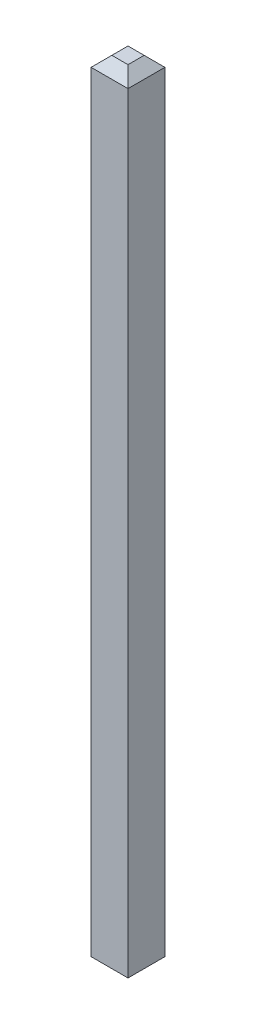
ISO-10303-21;
HEADER;
FILE_DESCRIPTION(('STEP AP214'),'2;1');
FILE_NAME('part.step','',(''),(''),'','','');
FILE_SCHEMA(('AUTOMOTIVE_DESIGN { 1 0 10303 214 1 1 1 1 }'));
ENDSEC;
DATA;
#1=APPLICATION_CONTEXT('core data for automotive mechanical design processes');
#2=APPLICATION_PROTOCOL_DEFINITION('international standard','automotive_design',2000,#1);
#3=PRODUCT_CONTEXT('',#1,'mechanical');
#4=PRODUCT('Part','Part','',(#3));
#5=PRODUCT_RELATED_PRODUCT_CATEGORY('part','',(#4));
#6=PRODUCT_DEFINITION_FORMATION('','',#4);
#7=PRODUCT_DEFINITION_CONTEXT('part definition',#1,'design');
#8=PRODUCT_DEFINITION('design','',#6,#7);
#9=PRODUCT_DEFINITION_SHAPE('','',#8);
#10=(LENGTH_UNIT() NAMED_UNIT(*) SI_UNIT(.MILLI.,.METRE.));
#11=(NAMED_UNIT(*) PLANE_ANGLE_UNIT() SI_UNIT($,.RADIAN.));
#12=(NAMED_UNIT(*) SI_UNIT($,.STERADIAN.) SOLID_ANGLE_UNIT());
#13=UNCERTAINTY_MEASURE_WITH_UNIT(LENGTH_MEASURE(1.E-05),#10,'distance_accuracy_value','');
#14=(GEOMETRIC_REPRESENTATION_CONTEXT(3) GLOBAL_UNCERTAINTY_ASSIGNED_CONTEXT((#13)) GLOBAL_UNIT_ASSIGNED_CONTEXT((#10,
#11,#12)) REPRESENTATION_CONTEXT('',''));
#15=CARTESIAN_POINT('',(0.,0.,0.));
#16=DIRECTION('',(0.,0.,1.));
#17=DIRECTION('',(1.,0.,0.));
#18=AXIS2_PLACEMENT_3D('',#15,#16,#17);
#19=CARTESIAN_POINT('',(-0.1778,0.,0.3556));
#20=DIRECTION('',(1.,0.,0.));
#21=DIRECTION('',(0.,1.,0.));
#22=AXIS2_PLACEMENT_3D('',#19,#20,#21);
#23=PLANE('',#22);
#24=DIRECTION('',(0.,-1.,0.));
#25=VECTOR('',#24,1.);
#26=CARTESIAN_POINT('',(-0.1778,0.,0.));
#27=LINE('',#26,#25);
#28=CARTESIAN_POINT('',(-0.177800000000002,7.52,0.));
#29=VERTEX_POINT('',#28);
#30=CARTESIAN_POINT('',(-0.1778,0.0999999999999994,0.));
#31=VERTEX_POINT('',#30);
#32=EDGE_CURVE('E116',#29,#31,#27,.T.);
#33=ORIENTED_EDGE('',*,*,#32,.T.);
#34=DIRECTION('',(0.,0.,1.));
#35=VECTOR('',#34,1.);
#36=CARTESIAN_POINT('',(-0.1778,0.0999999999999994,0.3556));
#37=LINE('',#36,#35);
#38=CARTESIAN_POINT('',(-0.1778,0.0999999999999994,0.3556));
#39=VERTEX_POINT('',#38);
#40=EDGE_CURVE('E137',#31,#39,#37,.T.);
#41=ORIENTED_EDGE('',*,*,#40,.T.);
#42=DIRECTION('',(0.,-1.,0.));
#43=VECTOR('',#42,1.);
#44=CARTESIAN_POINT('',(-0.1778,0.,0.3556));
#45=LINE('',#44,#43);
#46=CARTESIAN_POINT('',(-0.177800000000002,7.52,0.3556));
#47=VERTEX_POINT('',#46);
#48=EDGE_CURVE('E125',#47,#39,#45,.T.);
#49=ORIENTED_EDGE('',*,*,#48,.F.);
#50=DIRECTION('',(0.,0.,-1.));
#51=VECTOR('',#50,1.);
#52=CARTESIAN_POINT('',(-0.177800000000002,7.52,0.3556));
#53=LINE('',#52,#51);
#54=EDGE_CURVE('E134',#47,#29,#53,.T.);
#55=ORIENTED_EDGE('',*,*,#54,.T.);
#56=EDGE_LOOP('',(#33,#41,#49,#55));
#57=FACE_BOUND('',#56,.T.);
#58=ADVANCED_FACE('F32',(#57),#23,.F.);
#59=CARTESIAN_POINT('',(-0.1778,0.,0.3556));
#60=DIRECTION('',(0.,1.,0.));
#61=DIRECTION('',(-1.,0.,0.));
#62=AXIS2_PLACEMENT_3D('',#59,#60,#61);
#63=PLANE('',#62);
#64=DIRECTION('',(-1.,0.,0.));
#65=VECTOR('',#64,1.);
#66=CARTESIAN_POINT('',(-0.1778,0.,0.2556));
#67=LINE('',#66,#65);
#68=CARTESIAN_POINT('',(0.0778,0.,0.2556));
#69=VERTEX_POINT('',#68);
#70=CARTESIAN_POINT('',(-0.0777999999999997,0.,0.2556));
#71=VERTEX_POINT('',#70);
#72=EDGE_CURVE('E101',#69,#71,#67,.T.);
#73=ORIENTED_EDGE('',*,*,#72,.T.);
#74=DIRECTION('',(0.,0.,-1.));
#75=VECTOR('',#74,1.);
#76=CARTESIAN_POINT('',(-0.0777999999999997,0.,0.3556));
#77=LINE('',#76,#75);
#78=CARTESIAN_POINT('',(-0.0777999999999997,0.,0.1));
#79=VERTEX_POINT('',#78);
#80=EDGE_CURVE('E132',#71,#79,#77,.T.);
#81=ORIENTED_EDGE('',*,*,#80,.T.);
#82=DIRECTION('',(1.,0.,0.));
#83=VECTOR('',#82,1.);
#84=CARTESIAN_POINT('',(0.1778,0.,0.1));
#85=LINE('',#84,#83);
#86=CARTESIAN_POINT('',(0.0778,0.,0.1));
#87=VERTEX_POINT('',#86);
#88=EDGE_CURVE('E104',#79,#87,#85,.T.);
#89=ORIENTED_EDGE('',*,*,#88,.T.);
#90=DIRECTION('',(0.,0.,1.));
#91=VECTOR('',#90,1.);
#92=CARTESIAN_POINT('',(0.0778,0.,0.3556));
#93=LINE('',#92,#91);
#94=EDGE_CURVE('E96',#87,#69,#93,.T.);
#95=ORIENTED_EDGE('',*,*,#94,.T.);
#96=EDGE_LOOP('',(#73,#81,#89,#95));
#97=FACE_BOUND('',#96,.T.);
#98=ADVANCED_FACE('F98',(#97),#63,.F.);
#99=CARTESIAN_POINT('',(0.1778,0.,0.3556));
#100=DIRECTION('',(-1.,0.,0.));
#101=DIRECTION('',(0.,-1.,0.));
#102=AXIS2_PLACEMENT_3D('',#99,#100,#101);
#103=PLANE('',#102);
#104=DIRECTION('',(0.,1.,0.));
#105=VECTOR('',#104,1.);
#106=CARTESIAN_POINT('',(0.1778,0.,0.3556));
#107=LINE('',#106,#105);
#108=CARTESIAN_POINT('',(0.1778,0.0999999999999995,0.3556));
#109=VERTEX_POINT('',#108);
#110=CARTESIAN_POINT('',(0.1778,7.52,0.3556));
#111=VERTEX_POINT('',#110);
#112=EDGE_CURVE('E122',#109,#111,#107,.T.);
#113=ORIENTED_EDGE('',*,*,#112,.F.);
#114=DIRECTION('',(0.,0.,-1.));
#115=VECTOR('',#114,1.);
#116=CARTESIAN_POINT('',(0.1778,0.0999999999999994,0.3556));
#117=LINE('',#116,#115);
#118=CARTESIAN_POINT('',(0.1778,0.0999999999999994,0.));
#119=VERTEX_POINT('',#118);
#120=EDGE_CURVE('E113',#109,#119,#117,.T.);
#121=ORIENTED_EDGE('',*,*,#120,.T.);
#122=DIRECTION('',(0.,1.,0.));
#123=VECTOR('',#122,1.);
#124=CARTESIAN_POINT('',(0.1778,0.,0.));
#125=LINE('',#124,#123);
#126=CARTESIAN_POINT('',(0.1778,7.52,0.));
#127=VERTEX_POINT('',#126);
#128=EDGE_CURVE('E128',#119,#127,#125,.T.);
#129=ORIENTED_EDGE('',*,*,#128,.T.);
#130=DIRECTION('',(0.,0.,1.));
#131=VECTOR('',#130,1.);
#132=CARTESIAN_POINT('',(0.1778,7.52,0.3556));
#133=LINE('',#132,#131);
#134=EDGE_CURVE('E144',#127,#111,#133,.T.);
#135=ORIENTED_EDGE('',*,*,#134,.T.);
#136=EDGE_LOOP('',(#113,#121,#129,#135));
#137=FACE_BOUND('',#136,.T.);
#138=ADVANCED_FACE('F183',(#137),#103,.F.);
#139=CARTESIAN_POINT('',(-0.177800000000002,7.62,0.3556));
#140=DIRECTION('',(0.,-1.,0.));
#141=DIRECTION('',(0.,0.,-1.));
#142=AXIS2_PLACEMENT_3D('',#139,#140,#141);
#143=PLANE('',#142);
#144=DIRECTION('',(-1.,0.,0.));
#145=VECTOR('',#144,1.);
#146=CARTESIAN_POINT('',(-0.177800000000002,7.62,0.1));
#147=LINE('',#146,#145);
#148=CARTESIAN_POINT('',(0.0777999999999999,7.62,0.1));
#149=VERTEX_POINT('',#148);
#150=CARTESIAN_POINT('',(-0.0778000000000015,7.62,0.1));
#151=VERTEX_POINT('',#150);
#152=EDGE_CURVE('E41',#149,#151,#147,.T.);
#153=ORIENTED_EDGE('',*,*,#152,.T.);
#154=DIRECTION('',(0.,0.,1.));
#155=VECTOR('',#154,1.);
#156=CARTESIAN_POINT('',(-0.0778000000000015,7.62,0.3556));
#157=LINE('',#156,#155);
#158=CARTESIAN_POINT('',(-0.0778000000000015,7.62,0.2556));
#159=VERTEX_POINT('',#158);
#160=EDGE_CURVE('E11',#151,#159,#157,.T.);
#161=ORIENTED_EDGE('',*,*,#160,.T.);
#162=DIRECTION('',(1.,0.,0.));
#163=VECTOR('',#162,1.);
#164=CARTESIAN_POINT('',(-0.177800000000002,7.62,0.2556));
#165=LINE('',#164,#163);
#166=CARTESIAN_POINT('',(0.0777999999999999,7.62,0.2556));
#167=VERTEX_POINT('',#166);
#168=EDGE_CURVE('E151',#159,#167,#165,.T.);
#169=ORIENTED_EDGE('',*,*,#168,.T.);
#170=DIRECTION('',(0.,0.,-1.));
#171=VECTOR('',#170,1.);
#172=CARTESIAN_POINT('',(0.0777999999999999,7.62,0.3556));
#173=LINE('',#172,#171);
#174=EDGE_CURVE('E52',#167,#149,#173,.T.);
#175=ORIENTED_EDGE('',*,*,#174,.T.);
#176=EDGE_LOOP('',(#153,#161,#169,#175));
#177=FACE_BOUND('',#176,.T.);
#178=ADVANCED_FACE('F180',(#177),#143,.F.);
#179=CARTESIAN_POINT('',(0.,0.,0.3556));
#180=DIRECTION('',(0.,0.,-1.));
#181=DIRECTION('',(-1.,0.,0.));
#182=AXIS2_PLACEMENT_3D('',#179,#180,#181);
#183=PLANE('',#182);
#184=ORIENTED_EDGE('',*,*,#48,.T.);
#185=DIRECTION('',(1.,0.,0.));
#186=VECTOR('',#185,1.);
#187=CARTESIAN_POINT('',(0.,0.0999999999999994,0.3556));
#188=LINE('',#187,#186);
#189=EDGE_CURVE('E149',#39,#109,#188,.T.);
#190=ORIENTED_EDGE('',*,*,#189,.T.);
#191=ORIENTED_EDGE('',*,*,#112,.T.);
#192=DIRECTION('',(-1.,0.,0.));
#193=VECTOR('',#192,1.);
#194=CARTESIAN_POINT('',(0.,7.52,0.3556));
#195=LINE('',#194,#193);
#196=EDGE_CURVE('E147',#111,#47,#195,.T.);
#197=ORIENTED_EDGE('',*,*,#196,.T.);
#198=EDGE_LOOP('',(#184,#190,#191,#197));
#199=FACE_BOUND('',#198,.T.);
#200=ADVANCED_FACE('F182',(#199),#183,.F.);
#201=CARTESIAN_POINT('',(0.,0.,0.));
#202=DIRECTION('',(0.,0.,-1.));
#203=DIRECTION('',(-1.,0.,0.));
#204=AXIS2_PLACEMENT_3D('',#201,#202,#203);
#205=PLANE('',#204);
#206=ORIENTED_EDGE('',*,*,#128,.F.);
#207=DIRECTION('',(-1.,0.,0.));
#208=VECTOR('',#207,1.);
#209=CARTESIAN_POINT('',(-0.1778,0.0999999999999994,0.));
#210=LINE('',#209,#208);
#211=EDGE_CURVE('E142',#119,#31,#210,.T.);
#212=ORIENTED_EDGE('',*,*,#211,.T.);
#213=ORIENTED_EDGE('',*,*,#32,.F.);
#214=DIRECTION('',(1.,0.,0.));
#215=VECTOR('',#214,1.);
#216=CARTESIAN_POINT('',(0.1778,7.52,0.));
#217=LINE('',#216,#215);
#218=EDGE_CURVE('E140',#29,#127,#217,.T.);
#219=ORIENTED_EDGE('',*,*,#218,.T.);
#220=EDGE_LOOP('',(#206,#212,#213,#219));
#221=FACE_BOUND('',#220,.T.);
#222=ADVANCED_FACE('F189',(#221),#205,.T.);
#223=CARTESIAN_POINT('',(0.1778,0.0999999999999994,0.3556));
#224=DIRECTION('',(-0.707106781186545,0.707106781186551,0.));
#225=DIRECTION('',(0.,0.,-1.));
#226=AXIS2_PLACEMENT_3D('',#223,#224,#225);
#227=PLANE('',#226);
#228=DIRECTION('',(-0.577350269189627,-0.577350269189623,0.577350269189627));
#229=VECTOR('',#228,1.);
#230=CARTESIAN_POINT('',(0.0592666666666663,-0.0185333333333336,0.118533333333334));
#231=LINE('',#230,#229);
#232=EDGE_CURVE('E117',#119,#87,#231,.T.);
#233=ORIENTED_EDGE('',*,*,#232,.F.);
#234=ORIENTED_EDGE('',*,*,#120,.F.);
#235=DIRECTION('',(0.577350269189627,0.577350269189623,0.577350269189627));
#236=VECTOR('',#235,1.);
#237=CARTESIAN_POINT('',(0.118533333333333,0.0407333333333328,0.296333333333333));
#238=LINE('',#237,#236);
#239=EDGE_CURVE('E111',#69,#109,#238,.T.);
#240=ORIENTED_EDGE('',*,*,#239,.F.);
#241=ORIENTED_EDGE('',*,*,#94,.F.);
#242=EDGE_LOOP('',(#233,#234,#240,#241));
#243=FACE_BOUND('',#242,.T.);
#244=ADVANCED_FACE('F112',(#243),#227,.F.);
#245=CARTESIAN_POINT('',(0.,0.0999999999999994,0.3556));
#246=DIRECTION('',(0.,0.707106781186551,-0.707106781186544));
#247=DIRECTION('',(1.,0.,0.));
#248=AXIS2_PLACEMENT_3D('',#245,#246,#247);
#249=PLANE('',#248);
#250=ORIENTED_EDGE('',*,*,#239,.T.);
#251=ORIENTED_EDGE('',*,*,#189,.F.);
#252=DIRECTION('',(0.577350269189628,-0.577350269189622,-0.577350269189627));
#253=VECTOR('',#252,1.);
#254=CARTESIAN_POINT('',(-0.118533333333333,0.0407333333333329,0.296333333333333));
#255=LINE('',#254,#253);
#256=EDGE_CURVE('E120',#71,#39,#255,.F.);
#257=ORIENTED_EDGE('',*,*,#256,.F.);
#258=ORIENTED_EDGE('',*,*,#72,.F.);
#259=EDGE_LOOP('',(#250,#251,#257,#258));
#260=FACE_BOUND('',#259,.T.);
#261=ADVANCED_FACE('F119',(#260),#249,.F.);
#262=CARTESIAN_POINT('',(-0.1778,0.,0.1));
#263=DIRECTION('',(0.,-0.707106781186551,-0.707106781186544));
#264=DIRECTION('',(-1.,0.,0.));
#265=AXIS2_PLACEMENT_3D('',#262,#263,#264);
#266=PLANE('',#265);
#267=ORIENTED_EDGE('',*,*,#232,.T.);
#268=ORIENTED_EDGE('',*,*,#88,.F.);
#269=DIRECTION('',(0.577350269189628,-0.577350269189622,0.577350269189627));
#270=VECTOR('',#269,1.);
#271=CARTESIAN_POINT('',(-0.111133333333333,0.0333333333333333,0.0666666666666667));
#272=LINE('',#271,#270);
#273=EDGE_CURVE('E155',#31,#79,#272,.T.);
#274=ORIENTED_EDGE('',*,*,#273,.F.);
#275=ORIENTED_EDGE('',*,*,#211,.F.);
#276=EDGE_LOOP('',(#267,#268,#274,#275));
#277=FACE_BOUND('',#276,.T.);
#278=ADVANCED_FACE('F207',(#277),#266,.T.);
#279=CARTESIAN_POINT('',(-0.0777999999999997,0.,0.3556));
#280=DIRECTION('',(0.707106781186544,0.707106781186551,0.));
#281=DIRECTION('',(0.,0.,-1.));
#282=AXIS2_PLACEMENT_3D('',#279,#280,#281);
#283=PLANE('',#282);
#284=ORIENTED_EDGE('',*,*,#256,.T.);
#285=ORIENTED_EDGE('',*,*,#40,.F.);
#286=ORIENTED_EDGE('',*,*,#273,.T.);
#287=ORIENTED_EDGE('',*,*,#80,.F.);
#288=EDGE_LOOP('',(#284,#285,#286,#287));
#289=FACE_BOUND('',#288,.T.);
#290=ADVANCED_FACE('F204',(#289),#283,.F.);
#291=CARTESIAN_POINT('',(0.0777999999999999,7.62,0.3556));
#292=DIRECTION('',(-0.707106781186547,-0.707106781186547,0.));
#293=DIRECTION('',(0.,0.,-1.));
#294=AXIS2_PLACEMENT_3D('',#291,#292,#293);
#295=PLANE('',#294);
#296=DIRECTION('',(0.577350269189626,-0.577350269189626,-0.577350269189626));
#297=VECTOR('',#296,1.);
#298=CARTESIAN_POINT('',(-0.0074,7.7052,0.1852));
#299=LINE('',#298,#297);
#300=EDGE_CURVE('E162',#149,#127,#299,.T.);
#301=ORIENTED_EDGE('',*,*,#300,.F.);
#302=ORIENTED_EDGE('',*,*,#174,.F.);
#303=DIRECTION('',(-0.577350269189626,0.577350269189626,-0.577350269189626));
#304=VECTOR('',#303,1.);
#305=CARTESIAN_POINT('',(0.118533333333333,7.57926666666667,0.296333333333333));
#306=LINE('',#305,#304);
#307=EDGE_CURVE('E36',#111,#167,#306,.T.);
#308=ORIENTED_EDGE('',*,*,#307,.F.);
#309=ORIENTED_EDGE('',*,*,#134,.F.);
#310=EDGE_LOOP('',(#301,#302,#308,#309));
#311=FACE_BOUND('',#310,.T.);
#312=ADVANCED_FACE('F34',(#311),#295,.F.);
#313=CARTESIAN_POINT('',(0.,7.52,0.3556));
#314=DIRECTION('',(0.,-0.707106781186547,-0.707106781186547));
#315=DIRECTION('',(-1.,0.,0.));
#316=AXIS2_PLACEMENT_3D('',#313,#314,#315);
#317=PLANE('',#316);
#318=ORIENTED_EDGE('',*,*,#307,.T.);
#319=ORIENTED_EDGE('',*,*,#168,.F.);
#320=DIRECTION('',(-0.577350269189626,-0.577350269189626,0.577350269189626));
#321=VECTOR('',#320,1.);
#322=CARTESIAN_POINT('',(-0.118533333333335,7.57926666666667,0.296333333333333));
#323=LINE('',#322,#321);
#324=EDGE_CURVE('E161',#47,#159,#323,.F.);
#325=ORIENTED_EDGE('',*,*,#324,.F.);
#326=ORIENTED_EDGE('',*,*,#196,.F.);
#327=EDGE_LOOP('',(#318,#319,#325,#326));
#328=FACE_BOUND('',#327,.T.);
#329=ADVANCED_FACE('F171',(#328),#317,.F.);
#330=CARTESIAN_POINT('',(-0.177800000000002,7.62,0.1));
#331=DIRECTION('',(0.,0.707106781186547,-0.707106781186547));
#332=DIRECTION('',(1.,0.,0.));
#333=AXIS2_PLACEMENT_3D('',#330,#331,#332);
#334=PLANE('',#333);
#335=ORIENTED_EDGE('',*,*,#300,.T.);
#336=ORIENTED_EDGE('',*,*,#218,.F.);
#337=DIRECTION('',(-0.577350269189626,-0.577350269189626,-0.577350269189626));
#338=VECTOR('',#337,1.);
#339=CARTESIAN_POINT('',(-0.111133333333335,7.58666666666667,0.0666666666666668));
#340=LINE('',#339,#338);
#341=EDGE_CURVE('E159',#151,#29,#340,.T.);
#342=ORIENTED_EDGE('',*,*,#341,.F.);
#343=ORIENTED_EDGE('',*,*,#152,.F.);
#344=EDGE_LOOP('',(#335,#336,#342,#343));
#345=FACE_BOUND('',#344,.T.);
#346=ADVANCED_FACE('F176',(#345),#334,.T.);
#347=CARTESIAN_POINT('',(-0.177800000000002,7.52,0.3556));
#348=DIRECTION('',(0.707106781186547,-0.707106781186547,0.));
#349=DIRECTION('',(0.,0.,-1.));
#350=AXIS2_PLACEMENT_3D('',#347,#348,#349);
#351=PLANE('',#350);
#352=ORIENTED_EDGE('',*,*,#324,.T.);
#353=ORIENTED_EDGE('',*,*,#160,.F.);
#354=ORIENTED_EDGE('',*,*,#341,.T.);
#355=ORIENTED_EDGE('',*,*,#54,.F.);
#356=EDGE_LOOP('',(#352,#353,#354,#355));
#357=FACE_BOUND('',#356,.T.);
#358=ADVANCED_FACE('F179',(#357),#351,.F.);
#359=CLOSED_SHELL('',(#58,#98,#138,#178,#200,#222,#244,#261,#278,#290,#312,#329,#346,#358));
#360=MANIFOLD_SOLID_BREP('B2',#359);
#361=ADVANCED_BREP_SHAPE_REPRESENTATION('',(#18,#360),#14);
#362=SHAPE_DEFINITION_REPRESENTATION(#9,#361);
ENDSEC;
END-ISO-10303-21;
